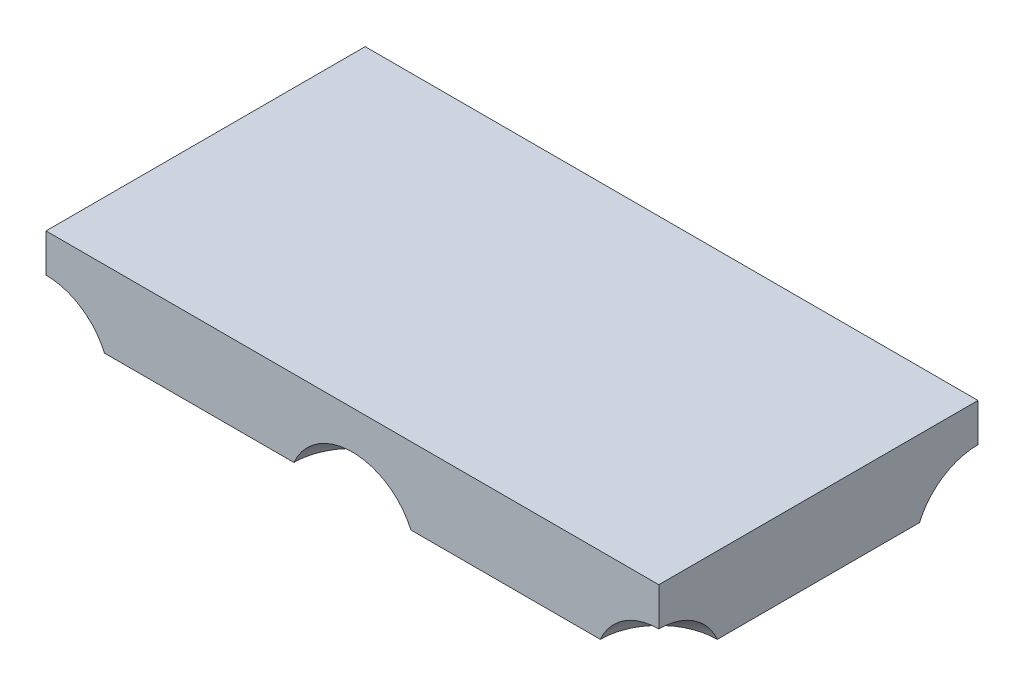
ISO-10303-21;
HEADER;
FILE_DESCRIPTION(('STEP AP214'),'2;1');
FILE_NAME('part.step','',(''),(''),'','','');
FILE_SCHEMA(('AUTOMOTIVE_DESIGN { 1 0 10303 214 1 1 1 1 }'));
ENDSEC;
DATA;
#1=APPLICATION_CONTEXT('core data for automotive mechanical design processes');
#2=APPLICATION_PROTOCOL_DEFINITION('international standard','automotive_design',2000,#1);
#3=PRODUCT_CONTEXT('',#1,'mechanical');
#4=PRODUCT('Part','Part','',(#3));
#5=PRODUCT_RELATED_PRODUCT_CATEGORY('part','',(#4));
#6=PRODUCT_DEFINITION_FORMATION('','',#4);
#7=PRODUCT_DEFINITION_CONTEXT('part definition',#1,'design');
#8=PRODUCT_DEFINITION('design','',#6,#7);
#9=PRODUCT_DEFINITION_SHAPE('','',#8);
#10=(LENGTH_UNIT() NAMED_UNIT(*) SI_UNIT(.MILLI.,.METRE.));
#11=(NAMED_UNIT(*) PLANE_ANGLE_UNIT() SI_UNIT($,.RADIAN.));
#12=(NAMED_UNIT(*) SI_UNIT($,.STERADIAN.) SOLID_ANGLE_UNIT());
#13=UNCERTAINTY_MEASURE_WITH_UNIT(LENGTH_MEASURE(1.E-05),#10,'distance_accuracy_value','');
#14=(GEOMETRIC_REPRESENTATION_CONTEXT(3) GLOBAL_UNCERTAINTY_ASSIGNED_CONTEXT((#13)) GLOBAL_UNIT_ASSIGNED_CONTEXT((#10,
#11,#12)) REPRESENTATION_CONTEXT('',''));
#15=CARTESIAN_POINT('',(0.,0.,0.));
#16=DIRECTION('',(0.,0.,1.));
#17=DIRECTION('',(1.,0.,0.));
#18=AXIS2_PLACEMENT_3D('',#15,#16,#17);
#19=CARTESIAN_POINT('',(-609.6,-50.8,317.5));
#20=DIRECTION('',(-1.,0.,0.));
#21=DIRECTION('',(0.,0.,1.));
#22=AXIS2_PLACEMENT_3D('',#19,#20,#21);
#23=SPHERICAL_SURFACE('',#22,127.);
#24=CARTESIAN_POINT('',(-609.6,-50.8,317.5));
#25=DIRECTION('',(-1.,0.,0.));
#26=DIRECTION('',(0.,0.,1.));
#27=AXIS2_PLACEMENT_3D('',#24,#25,#26);
#28=CIRCLE('',#27,127.);
#29=CARTESIAN_POINT('',(-609.6,76.2,317.5));
#30=VERTEX_POINT('',#29);
#31=CARTESIAN_POINT('',(-609.6,0.,201.102577348122));
#32=VERTEX_POINT('',#31);
#33=EDGE_CURVE('E49',#30,#32,#28,.T.);
#34=ORIENTED_EDGE('',*,*,#33,.T.);
#35=CARTESIAN_POINT('',(-609.6,0.,317.5));
#36=DIRECTION('',(0.,1.,0.));
#37=DIRECTION('',(0.,0.,1.));
#38=AXIS2_PLACEMENT_3D('',#35,#36,#37);
#39=CIRCLE('',#38,116.397422651878);
#40=CARTESIAN_POINT('',(-493.202577348122,0.,317.5));
#41=VERTEX_POINT('',#40);
#42=EDGE_CURVE('E169',#41,#32,#39,.T.);
#43=ORIENTED_EDGE('',*,*,#42,.F.);
#44=CARTESIAN_POINT('',(-609.6,-50.8,317.5));
#45=DIRECTION('',(0.,0.,-1.));
#46=DIRECTION('',(-1.,0.,0.));
#47=AXIS2_PLACEMENT_3D('',#44,#45,#46);
#48=CIRCLE('',#47,127.);
#49=EDGE_CURVE('E165',#30,#41,#48,.T.);
#50=ORIENTED_EDGE('',*,*,#49,.F.);
#51=EDGE_LOOP('',(#34,#43,#50));
#52=FACE_BOUND('',#51,.T.);
#53=ADVANCED_FACE('F45',(#52),#23,.F.);
#54=CARTESIAN_POINT('',(-1.11022302462516E-13,-50.8,317.5));
#55=DIRECTION('',(-1.,0.,0.));
#56=DIRECTION('',(0.,0.,1.));
#57=AXIS2_PLACEMENT_3D('',#54,#55,#56);
#58=SPHERICAL_SURFACE('',#57,127.);
#59=CARTESIAN_POINT('',(-1.11022302462516E-13,0.,317.5));
#60=DIRECTION('',(0.,1.,0.));
#61=DIRECTION('',(0.,0.,1.));
#62=AXIS2_PLACEMENT_3D('',#59,#60,#61);
#63=CIRCLE('',#62,116.397422651878);
#64=CARTESIAN_POINT('',(116.397422651878,0.,317.5));
#65=VERTEX_POINT('',#64);
#66=CARTESIAN_POINT('',(-116.397422651878,0.,317.5));
#67=VERTEX_POINT('',#66);
#68=EDGE_CURVE('E166',#65,#67,#63,.T.);
#69=ORIENTED_EDGE('',*,*,#68,.F.);
#70=CARTESIAN_POINT('',(-1.11022302462516E-13,-50.8,317.5));
#71=DIRECTION('',(0.,0.,-1.));
#72=DIRECTION('',(-1.,0.,0.));
#73=AXIS2_PLACEMENT_3D('',#70,#71,#72);
#74=CIRCLE('',#73,127.);
#75=EDGE_CURVE('E135',#67,#65,#74,.T.);
#76=ORIENTED_EDGE('',*,*,#75,.F.);
#77=EDGE_LOOP('',(#69,#76));
#78=FACE_BOUND('',#77,.T.);
#79=ADVANCED_FACE('F257',(#78),#58,.F.);
#80=CARTESIAN_POINT('',(609.6,-50.8,317.5));
#81=DIRECTION('',(-1.,0.,0.));
#82=DIRECTION('',(0.,0.,1.));
#83=AXIS2_PLACEMENT_3D('',#80,#81,#82);
#84=SPHERICAL_SURFACE('',#83,127.);
#85=CARTESIAN_POINT('',(609.6,0.,317.5));
#86=DIRECTION('',(0.,1.,0.));
#87=DIRECTION('',(0.,0.,1.));
#88=AXIS2_PLACEMENT_3D('',#85,#86,#87);
#89=CIRCLE('',#88,116.397422651878);
#90=CARTESIAN_POINT('',(609.6,0.,201.102577348122));
#91=VERTEX_POINT('',#90);
#92=CARTESIAN_POINT('',(493.202577348122,0.,317.5));
#93=VERTEX_POINT('',#92);
#94=EDGE_CURVE('E138',#91,#93,#89,.T.);
#95=ORIENTED_EDGE('',*,*,#94,.F.);
#96=CARTESIAN_POINT('',(609.6,-50.8,317.5));
#97=DIRECTION('',(-1.,0.,0.));
#98=DIRECTION('',(0.,0.,1.));
#99=AXIS2_PLACEMENT_3D('',#96,#97,#98);
#100=CIRCLE('',#99,127.);
#101=CARTESIAN_POINT('',(609.6,76.2,317.5));
#102=VERTEX_POINT('',#101);
#103=EDGE_CURVE('E134',#102,#91,#100,.T.);
#104=ORIENTED_EDGE('',*,*,#103,.F.);
#105=CARTESIAN_POINT('',(609.6,-50.8,317.5));
#106=DIRECTION('',(0.,0.,-1.));
#107=DIRECTION('',(-1.,0.,0.));
#108=AXIS2_PLACEMENT_3D('',#105,#106,#107);
#109=CIRCLE('',#108,127.);
#110=EDGE_CURVE('E123',#93,#102,#109,.T.);
#111=ORIENTED_EDGE('',*,*,#110,.F.);
#112=EDGE_LOOP('',(#95,#104,#111));
#113=FACE_BOUND('',#112,.T.);
#114=ADVANCED_FACE('F137',(#113),#84,.F.);
#115=CARTESIAN_POINT('',(-609.6,-50.8,-317.5));
#116=DIRECTION('',(-1.,0.,0.));
#117=DIRECTION('',(0.,0.,1.));
#118=AXIS2_PLACEMENT_3D('',#115,#116,#117);
#119=SPHERICAL_SURFACE('',#118,127.);
#120=CARTESIAN_POINT('',(-609.6,-50.8,-317.5));
#121=DIRECTION('',(0.,0.,-1.));
#122=DIRECTION('',(-1.,0.,0.));
#123=AXIS2_PLACEMENT_3D('',#120,#121,#122);
#124=CIRCLE('',#123,127.);
#125=CARTESIAN_POINT('',(-609.6,76.2,-317.5));
#126=VERTEX_POINT('',#125);
#127=CARTESIAN_POINT('',(-493.202577348122,0.,-317.5));
#128=VERTEX_POINT('',#127);
#129=EDGE_CURVE('E175',#126,#128,#124,.T.);
#130=ORIENTED_EDGE('',*,*,#129,.T.);
#131=CARTESIAN_POINT('',(-609.6,0.,-317.5));
#132=DIRECTION('',(0.,1.,0.));
#133=DIRECTION('',(0.,0.,1.));
#134=AXIS2_PLACEMENT_3D('',#131,#132,#133);
#135=CIRCLE('',#134,116.397422651878);
#136=CARTESIAN_POINT('',(-609.6,0.,-201.102577348122));
#137=VERTEX_POINT('',#136);
#138=EDGE_CURVE('E226',#137,#128,#135,.T.);
#139=ORIENTED_EDGE('',*,*,#138,.F.);
#140=CARTESIAN_POINT('',(-609.6,-50.8,-317.5));
#141=DIRECTION('',(-1.,0.,0.));
#142=DIRECTION('',(0.,0.,1.));
#143=AXIS2_PLACEMENT_3D('',#140,#141,#142);
#144=CIRCLE('',#143,127.);
#145=EDGE_CURVE('E190',#137,#126,#144,.T.);
#146=ORIENTED_EDGE('',*,*,#145,.T.);
#147=EDGE_LOOP('',(#130,#139,#146));
#148=FACE_BOUND('',#147,.T.);
#149=ADVANCED_FACE('F266',(#148),#119,.F.);
#150=CARTESIAN_POINT('',(-1.11022302462516E-13,-50.8,-317.5));
#151=DIRECTION('',(-1.,0.,0.));
#152=DIRECTION('',(0.,0.,1.));
#153=AXIS2_PLACEMENT_3D('',#150,#151,#152);
#154=SPHERICAL_SURFACE('',#153,127.);
#155=CARTESIAN_POINT('',(-1.11022302462516E-13,-50.8,-317.5));
#156=DIRECTION('',(0.,0.,-1.));
#157=DIRECTION('',(-1.,0.,0.));
#158=AXIS2_PLACEMENT_3D('',#155,#156,#157);
#159=CIRCLE('',#158,127.);
#160=CARTESIAN_POINT('',(-116.397422651878,0.,-317.5));
#161=VERTEX_POINT('',#160);
#162=CARTESIAN_POINT('',(116.397422651878,0.,-317.5));
#163=VERTEX_POINT('',#162);
#164=EDGE_CURVE('E172',#161,#163,#159,.T.);
#165=ORIENTED_EDGE('',*,*,#164,.T.);
#166=CARTESIAN_POINT('',(-1.11022302462516E-13,0.,-317.5));
#167=DIRECTION('',(0.,1.,0.));
#168=DIRECTION('',(0.,0.,1.));
#169=AXIS2_PLACEMENT_3D('',#166,#167,#168);
#170=CIRCLE('',#169,116.397422651878);
#171=EDGE_CURVE('E155',#161,#163,#170,.T.);
#172=ORIENTED_EDGE('',*,*,#171,.F.);
#173=EDGE_LOOP('',(#165,#172));
#174=FACE_BOUND('',#173,.T.);
#175=ADVANCED_FACE('F47',(#174),#154,.F.);
#176=CARTESIAN_POINT('',(609.6,-50.8,-317.5));
#177=DIRECTION('',(-1.,0.,0.));
#178=DIRECTION('',(0.,0.,1.));
#179=AXIS2_PLACEMENT_3D('',#176,#177,#178);
#180=SPHERICAL_SURFACE('',#179,127.);
#181=CARTESIAN_POINT('',(609.6,0.,-317.5));
#182=DIRECTION('',(0.,1.,0.));
#183=DIRECTION('',(0.,0.,1.));
#184=AXIS2_PLACEMENT_3D('',#181,#182,#183);
#185=CIRCLE('',#184,116.397422651878);
#186=CARTESIAN_POINT('',(493.202577348122,0.,-317.5));
#187=VERTEX_POINT('',#186);
#188=CARTESIAN_POINT('',(609.6,0.,-201.102577348122));
#189=VERTEX_POINT('',#188);
#190=EDGE_CURVE('E147',#187,#189,#185,.T.);
#191=ORIENTED_EDGE('',*,*,#190,.F.);
#192=CARTESIAN_POINT('',(609.6,-50.8,-317.5));
#193=DIRECTION('',(0.,0.,-1.));
#194=DIRECTION('',(-1.,0.,0.));
#195=AXIS2_PLACEMENT_3D('',#192,#193,#194);
#196=CIRCLE('',#195,127.);
#197=CARTESIAN_POINT('',(609.6,76.2,-317.5));
#198=VERTEX_POINT('',#197);
#199=EDGE_CURVE('E176',#187,#198,#196,.T.);
#200=ORIENTED_EDGE('',*,*,#199,.T.);
#201=CARTESIAN_POINT('',(609.6,-50.8,-317.5));
#202=DIRECTION('',(-1.,0.,0.));
#203=DIRECTION('',(0.,0.,1.));
#204=AXIS2_PLACEMENT_3D('',#201,#202,#203);
#205=CIRCLE('',#204,127.);
#206=EDGE_CURVE('E142',#189,#198,#205,.T.);
#207=ORIENTED_EDGE('',*,*,#206,.F.);
#208=EDGE_LOOP('',(#191,#200,#207));
#209=FACE_BOUND('',#208,.T.);
#210=ADVANCED_FACE('F246',(#209),#180,.F.);
#211=CARTESIAN_POINT('',(0.,152.4,0.));
#212=DIRECTION('',(0.,1.,0.));
#213=DIRECTION('',(0.,0.,1.));
#214=AXIS2_PLACEMENT_3D('',#211,#212,#213);
#215=PLANE('',#214);
#216=DIRECTION('',(1.,0.,0.));
#217=VECTOR('',#216,1.);
#218=CARTESIAN_POINT('',(-609.6,152.4,317.5));
#219=LINE('',#218,#217);
#220=CARTESIAN_POINT('',(-609.6,152.4,317.5));
#221=VERTEX_POINT('',#220);
#222=CARTESIAN_POINT('',(609.6,152.4,317.5));
#223=VERTEX_POINT('',#222);
#224=EDGE_CURVE('E206',#221,#223,#219,.T.);
#225=ORIENTED_EDGE('',*,*,#224,.T.);
#226=DIRECTION('',(0.,0.,-1.));
#227=VECTOR('',#226,1.);
#228=CARTESIAN_POINT('',(609.6,152.4,317.5));
#229=LINE('',#228,#227);
#230=CARTESIAN_POINT('',(609.6,152.4,-317.5));
#231=VERTEX_POINT('',#230);
#232=EDGE_CURVE('E63',#223,#231,#229,.T.);
#233=ORIENTED_EDGE('',*,*,#232,.T.);
#234=DIRECTION('',(1.,0.,0.));
#235=VECTOR('',#234,1.);
#236=CARTESIAN_POINT('',(-609.6,152.4,-317.5));
#237=LINE('',#236,#235);
#238=CARTESIAN_POINT('',(-609.6,152.4,-317.5));
#239=VERTEX_POINT('',#238);
#240=EDGE_CURVE('E212',#239,#231,#237,.T.);
#241=ORIENTED_EDGE('',*,*,#240,.F.);
#242=DIRECTION('',(0.,0.,-1.));
#243=VECTOR('',#242,1.);
#244=CARTESIAN_POINT('',(-609.6,152.4,317.5));
#245=LINE('',#244,#243);
#246=EDGE_CURVE('E219',#221,#239,#245,.T.);
#247=ORIENTED_EDGE('',*,*,#246,.F.);
#248=EDGE_LOOP('',(#225,#233,#241,#247));
#249=FACE_BOUND('',#248,.T.);
#250=ADVANCED_FACE('F241',(#249),#215,.T.);
#251=CARTESIAN_POINT('',(609.6,152.4,317.5));
#252=DIRECTION('',(-1.,0.,0.));
#253=DIRECTION('',(0.,0.,1.));
#254=AXIS2_PLACEMENT_3D('',#251,#252,#253);
#255=PLANE('',#254);
#256=DIRECTION('',(0.,-1.,0.));
#257=VECTOR('',#256,1.);
#258=CARTESIAN_POINT('',(609.6,152.4,317.5));
#259=LINE('',#258,#257);
#260=EDGE_CURVE('E128',#223,#102,#259,.T.);
#261=ORIENTED_EDGE('',*,*,#260,.T.);
#262=ORIENTED_EDGE('',*,*,#103,.T.);
#263=DIRECTION('',(0.,0.,-1.));
#264=VECTOR('',#263,1.);
#265=CARTESIAN_POINT('',(609.6,0.,317.5));
#266=LINE('',#265,#264);
#267=EDGE_CURVE('E159',#91,#189,#266,.T.);
#268=ORIENTED_EDGE('',*,*,#267,.T.);
#269=ORIENTED_EDGE('',*,*,#206,.T.);
#270=DIRECTION('',(0.,-1.,0.));
#271=VECTOR('',#270,1.);
#272=CARTESIAN_POINT('',(609.6,152.4,-317.5));
#273=LINE('',#272,#271);
#274=EDGE_CURVE('E146',#231,#198,#273,.T.);
#275=ORIENTED_EDGE('',*,*,#274,.F.);
#276=ORIENTED_EDGE('',*,*,#232,.F.);
#277=EDGE_LOOP('',(#261,#262,#268,#269,#275,#276));
#278=FACE_BOUND('',#277,.T.);
#279=ADVANCED_FACE('F144',(#278),#255,.F.);
#280=CARTESIAN_POINT('',(-609.6,152.4,-317.5));
#281=DIRECTION('',(0.,0.,-1.));
#282=DIRECTION('',(-1.,0.,0.));
#283=AXIS2_PLACEMENT_3D('',#280,#281,#282);
#284=PLANE('',#283);
#285=ORIENTED_EDGE('',*,*,#129,.F.);
#286=DIRECTION('',(0.,-1.,0.));
#287=VECTOR('',#286,1.);
#288=CARTESIAN_POINT('',(-609.6,152.4,-317.5));
#289=LINE('',#288,#287);
#290=EDGE_CURVE('E152',#239,#126,#289,.T.);
#291=ORIENTED_EDGE('',*,*,#290,.F.);
#292=ORIENTED_EDGE('',*,*,#240,.T.);
#293=ORIENTED_EDGE('',*,*,#274,.T.);
#294=ORIENTED_EDGE('',*,*,#199,.F.);
#295=DIRECTION('',(1.,0.,0.));
#296=VECTOR('',#295,1.);
#297=CARTESIAN_POINT('',(-609.6,0.,-317.5));
#298=LINE('',#297,#296);
#299=EDGE_CURVE('E162',#163,#187,#298,.T.);
#300=ORIENTED_EDGE('',*,*,#299,.F.);
#301=ORIENTED_EDGE('',*,*,#164,.F.);
#302=EDGE_CURVE('E199',#128,#161,#298,.T.);
#303=ORIENTED_EDGE('',*,*,#302,.F.);
#304=EDGE_LOOP('',(#285,#291,#292,#293,#294,#300,#301,#303));
#305=FACE_BOUND('',#304,.T.);
#306=ADVANCED_FACE('F240',(#305),#284,.T.);
#307=CARTESIAN_POINT('',(-609.6,152.4,317.5));
#308=DIRECTION('',(-1.,0.,0.));
#309=DIRECTION('',(0.,0.,1.));
#310=AXIS2_PLACEMENT_3D('',#307,#308,#309);
#311=PLANE('',#310);
#312=ORIENTED_EDGE('',*,*,#33,.F.);
#313=DIRECTION('',(0.,-1.,0.));
#314=VECTOR('',#313,1.);
#315=CARTESIAN_POINT('',(-609.6,152.4,317.5));
#316=LINE('',#315,#314);
#317=EDGE_CURVE('E216',#221,#30,#316,.T.);
#318=ORIENTED_EDGE('',*,*,#317,.F.);
#319=ORIENTED_EDGE('',*,*,#246,.T.);
#320=ORIENTED_EDGE('',*,*,#290,.T.);
#321=ORIENTED_EDGE('',*,*,#145,.F.);
#322=DIRECTION('',(0.,0.,-1.));
#323=VECTOR('',#322,1.);
#324=CARTESIAN_POINT('',(-609.6,0.,317.5));
#325=LINE('',#324,#323);
#326=EDGE_CURVE('E193',#32,#137,#325,.T.);
#327=ORIENTED_EDGE('',*,*,#326,.F.);
#328=EDGE_LOOP('',(#312,#318,#319,#320,#321,#327));
#329=FACE_BOUND('',#328,.T.);
#330=ADVANCED_FACE('F235',(#329),#311,.T.);
#331=CARTESIAN_POINT('',(-609.6,152.4,317.5));
#332=DIRECTION('',(0.,0.,-1.));
#333=DIRECTION('',(-1.,0.,0.));
#334=AXIS2_PLACEMENT_3D('',#331,#332,#333);
#335=PLANE('',#334);
#336=ORIENTED_EDGE('',*,*,#317,.T.);
#337=ORIENTED_EDGE('',*,*,#49,.T.);
#338=DIRECTION('',(1.,0.,0.));
#339=VECTOR('',#338,1.);
#340=CARTESIAN_POINT('',(-609.6,0.,317.5));
#341=LINE('',#340,#339);
#342=EDGE_CURVE('E55',#41,#67,#341,.T.);
#343=ORIENTED_EDGE('',*,*,#342,.T.);
#344=ORIENTED_EDGE('',*,*,#75,.T.);
#345=EDGE_CURVE('E11',#65,#93,#341,.T.);
#346=ORIENTED_EDGE('',*,*,#345,.T.);
#347=ORIENTED_EDGE('',*,*,#110,.T.);
#348=ORIENTED_EDGE('',*,*,#260,.F.);
#349=ORIENTED_EDGE('',*,*,#224,.F.);
#350=EDGE_LOOP('',(#336,#337,#343,#344,#346,#347,#348,#349));
#351=FACE_BOUND('',#350,.T.);
#352=ADVANCED_FACE('F126',(#351),#335,.F.);
#353=CARTESIAN_POINT('',(0.,0.,0.));
#354=DIRECTION('',(0.,1.,0.));
#355=DIRECTION('',(0.,0.,1.));
#356=AXIS2_PLACEMENT_3D('',#353,#354,#355);
#357=PLANE('',#356);
#358=ORIENTED_EDGE('',*,*,#342,.F.);
#359=ORIENTED_EDGE('',*,*,#42,.T.);
#360=ORIENTED_EDGE('',*,*,#326,.T.);
#361=ORIENTED_EDGE('',*,*,#138,.T.);
#362=ORIENTED_EDGE('',*,*,#302,.T.);
#363=ORIENTED_EDGE('',*,*,#171,.T.);
#364=ORIENTED_EDGE('',*,*,#299,.T.);
#365=ORIENTED_EDGE('',*,*,#190,.T.);
#366=ORIENTED_EDGE('',*,*,#267,.F.);
#367=ORIENTED_EDGE('',*,*,#94,.T.);
#368=ORIENTED_EDGE('',*,*,#345,.F.);
#369=ORIENTED_EDGE('',*,*,#68,.T.);
#370=EDGE_LOOP('',(#358,#359,#360,#361,#362,#363,#364,#365,#366,#367,#368,#369));
#371=FACE_BOUND('',#370,.T.);
#372=ADVANCED_FACE('F254',(#371),#357,.F.);
#373=CLOSED_SHELL('',(#53,#79,#114,#149,#175,#210,#250,#279,#306,#330,#352,#372));
#374=MANIFOLD_SOLID_BREP('B2',#373);
#375=ADVANCED_BREP_SHAPE_REPRESENTATION('',(#18,#374),#14);
#376=SHAPE_DEFINITION_REPRESENTATION(#9,#375);
ENDSEC;
END-ISO-10303-21;
